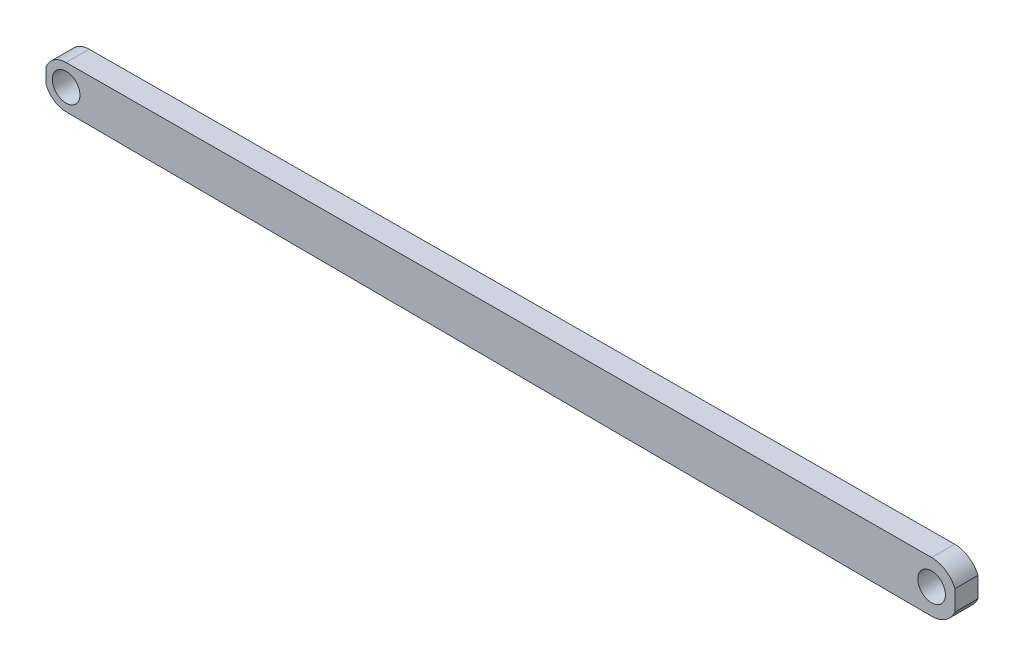
ISO-10303-21;
HEADER;
FILE_DESCRIPTION(('STEP AP214'),'2;1');
FILE_NAME('part.step','',(''),(''),'','','');
FILE_SCHEMA(('AUTOMOTIVE_DESIGN { 1 0 10303 214 1 1 1 1 }'));
ENDSEC;
DATA;
#1=APPLICATION_CONTEXT('core data for automotive mechanical design processes');
#2=APPLICATION_PROTOCOL_DEFINITION('international standard','automotive_design',2000,#1);
#3=PRODUCT_CONTEXT('',#1,'mechanical');
#4=PRODUCT('Part','Part','',(#3));
#5=PRODUCT_RELATED_PRODUCT_CATEGORY('part','',(#4));
#6=PRODUCT_DEFINITION_FORMATION('','',#4);
#7=PRODUCT_DEFINITION_CONTEXT('part definition',#1,'design');
#8=PRODUCT_DEFINITION('design','',#6,#7);
#9=PRODUCT_DEFINITION_SHAPE('','',#8);
#10=(LENGTH_UNIT() NAMED_UNIT(*) SI_UNIT(.MILLI.,.METRE.));
#11=(NAMED_UNIT(*) PLANE_ANGLE_UNIT() SI_UNIT($,.RADIAN.));
#12=(NAMED_UNIT(*) SI_UNIT($,.STERADIAN.) SOLID_ANGLE_UNIT());
#13=UNCERTAINTY_MEASURE_WITH_UNIT(LENGTH_MEASURE(1.E-05),#10,'distance_accuracy_value','');
#14=(GEOMETRIC_REPRESENTATION_CONTEXT(3) GLOBAL_UNCERTAINTY_ASSIGNED_CONTEXT((#13)) GLOBAL_UNIT_ASSIGNED_CONTEXT((#10,
#11,#12)) REPRESENTATION_CONTEXT('',''));
#15=CARTESIAN_POINT('',(0.,0.,0.));
#16=DIRECTION('',(0.,0.,1.));
#17=DIRECTION('',(1.,0.,0.));
#18=AXIS2_PLACEMENT_3D('',#15,#16,#17);
#19=CARTESIAN_POINT('',(0.,0.,5.));
#20=DIRECTION('',(0.,0.,1.));
#21=DIRECTION('',(1.,0.,0.));
#22=AXIS2_PLACEMENT_3D('',#19,#20,#21);
#23=PLANE('',#22);
#24=CARTESIAN_POINT('',(187.7624,0.,5.));
#25=DIRECTION('',(0.,0.,1.));
#26=DIRECTION('',(1.,0.,0.));
#27=AXIS2_PLACEMENT_3D('',#24,#25,#26);
#28=CIRCLE('',#27,3.00000007924962);
#29=CARTESIAN_POINT('',(190.76240007925,0.,5.));
#30=VERTEX_POINT('',#29);
#31=EDGE_CURVE('E169',#30,#30,#28,.T.);
#32=ORIENTED_EDGE('',*,*,#31,.F.);
#33=EDGE_LOOP('',(#32));
#34=FACE_BOUND('',#33,.T.);
#35=CARTESIAN_POINT('',(0.,0.,5.));
#36=DIRECTION('',(0.,0.,1.));
#37=DIRECTION('',(1.,0.,0.));
#38=AXIS2_PLACEMENT_3D('',#35,#36,#37);
#39=CIRCLE('',#38,3.00000007924961);
#40=CARTESIAN_POINT('',(3.00000007924961,0.,5.));
#41=VERTEX_POINT('',#40);
#42=EDGE_CURVE('E140',#41,#41,#39,.T.);
#43=ORIENTED_EDGE('',*,*,#42,.F.);
#44=EDGE_LOOP('',(#43));
#45=FACE_BOUND('',#44,.T.);
#46=CARTESIAN_POINT('',(0.,0.,5.));
#47=DIRECTION('',(0.,0.,1.));
#48=DIRECTION('',(1.,0.,0.));
#49=AXIS2_PLACEMENT_3D('',#46,#47,#48);
#50=CIRCLE('',#49,4.63518821296482);
#51=CARTESIAN_POINT('',(0.,4.63518821296482,5.));
#52=VERTEX_POINT('',#51);
#53=CARTESIAN_POINT('',(-4.35681947691644,1.58211687784739,5.));
#54=VERTEX_POINT('',#53);
#55=EDGE_CURVE('E154',#52,#54,#50,.T.);
#56=ORIENTED_EDGE('',*,*,#55,.T.);
#57=DIRECTION('',(0.,1.,0.));
#58=VECTOR('',#57,1.);
#59=CARTESIAN_POINT('',(-4.35681947691644,0.,5.));
#60=LINE('',#59,#58);
#61=CARTESIAN_POINT('',(-4.35681947691644,-1.58211687784739,5.));
#62=VERTEX_POINT('',#61);
#63=EDGE_CURVE('E101',#62,#54,#60,.T.);
#64=ORIENTED_EDGE('',*,*,#63,.F.);
#65=CARTESIAN_POINT('',(0.,-4.63518821296482,5.));
#66=VERTEX_POINT('',#65);
#67=EDGE_CURVE('E151',#62,#66,#50,.T.);
#68=ORIENTED_EDGE('',*,*,#67,.T.);
#69=DIRECTION('',(-0.999988830954034,0.00472630587074901,0.));
#70=VECTOR('',#69,1.);
#71=CARTESIAN_POINT('',(-0.0219070725791288,-4.63508467228263,5.));
#72=LINE('',#71,#70);
#73=CARTESIAN_POINT('',(187.7624,-5.52262065816452,5.));
#74=VERTEX_POINT('',#73);
#75=EDGE_CURVE('E160',#74,#66,#72,.T.);
#76=ORIENTED_EDGE('',*,*,#75,.F.);
#77=CARTESIAN_POINT('',(187.7624,0.,5.));
#78=DIRECTION('',(0.,0.,1.));
#79=DIRECTION('',(1.,0.,0.));
#80=AXIS2_PLACEMENT_3D('',#77,#78,#79);
#81=CIRCLE('',#80,5.52262065816452);
#82=CARTESIAN_POINT('',(192.829341952088,-2.19668800428204,5.));
#83=VERTEX_POINT('',#82);
#84=EDGE_CURVE('E166',#74,#83,#81,.T.);
#85=ORIENTED_EDGE('',*,*,#84,.T.);
#86=DIRECTION('',(0.,-1.,0.));
#87=VECTOR('',#86,1.);
#88=CARTESIAN_POINT('',(192.829341952088,0.,5.));
#89=LINE('',#88,#87);
#90=CARTESIAN_POINT('',(192.829341952088,2.19668800428204,5.));
#91=VERTEX_POINT('',#90);
#92=EDGE_CURVE('E155',#91,#83,#89,.T.);
#93=ORIENTED_EDGE('',*,*,#92,.F.);
#94=CARTESIAN_POINT('',(187.7624,5.52262065816452,5.));
#95=VERTEX_POINT('',#94);
#96=EDGE_CURVE('E165',#91,#95,#81,.T.);
#97=ORIENTED_EDGE('',*,*,#96,.T.);
#98=DIRECTION('',(-0.999988830954034,-0.00472630587074901,0.));
#99=VECTOR('',#98,1.);
#100=CARTESIAN_POINT('',(-0.0219070725791288,4.63508467228263,5.));
#101=LINE('',#100,#99);
#102=EDGE_CURVE('E135',#95,#52,#101,.T.);
#103=ORIENTED_EDGE('',*,*,#102,.T.);
#104=EDGE_LOOP('',(#56,#64,#68,#76,#85,#93,#97,#103));
#105=FACE_BOUND('',#104,.T.);
#106=ADVANCED_FACE('F37',(#34,#45,#105),#23,.T.);
#107=CARTESIAN_POINT('',(0.,0.,0.));
#108=DIRECTION('',(0.,0.,1.));
#109=DIRECTION('',(1.,0.,0.));
#110=AXIS2_PLACEMENT_3D('',#107,#108,#109);
#111=PLANE('',#110);
#112=CARTESIAN_POINT('',(187.7624,0.,0.));
#113=DIRECTION('',(0.,0.,1.));
#114=DIRECTION('',(1.,0.,0.));
#115=AXIS2_PLACEMENT_3D('',#112,#113,#114);
#116=CIRCLE('',#115,3.00000007924962);
#117=CARTESIAN_POINT('',(190.76240007925,0.,0.));
#118=VERTEX_POINT('',#117);
#119=EDGE_CURVE('E129',#118,#118,#116,.T.);
#120=ORIENTED_EDGE('',*,*,#119,.T.);
#121=EDGE_LOOP('',(#120));
#122=FACE_BOUND('',#121,.T.);
#123=CARTESIAN_POINT('',(0.,0.,0.));
#124=DIRECTION('',(0.,0.,1.));
#125=DIRECTION('',(1.,0.,0.));
#126=AXIS2_PLACEMENT_3D('',#123,#124,#125);
#127=CIRCLE('',#126,3.00000007924961);
#128=CARTESIAN_POINT('',(3.00000007924961,0.,0.));
#129=VERTEX_POINT('',#128);
#130=EDGE_CURVE('E132',#129,#129,#127,.T.);
#131=ORIENTED_EDGE('',*,*,#130,.T.);
#132=EDGE_LOOP('',(#131));
#133=FACE_BOUND('',#132,.T.);
#134=DIRECTION('',(0.,1.,0.));
#135=VECTOR('',#134,1.);
#136=CARTESIAN_POINT('',(-4.35681947691644,0.,0.));
#137=LINE('',#136,#135);
#138=CARTESIAN_POINT('',(-4.35681947691644,-1.58211687784739,0.));
#139=VERTEX_POINT('',#138);
#140=CARTESIAN_POINT('',(-4.35681947691644,1.58211687784739,0.));
#141=VERTEX_POINT('',#140);
#142=EDGE_CURVE('E51',#139,#141,#137,.T.);
#143=ORIENTED_EDGE('',*,*,#142,.T.);
#144=CARTESIAN_POINT('',(0.,0.,0.));
#145=DIRECTION('',(0.,0.,1.));
#146=DIRECTION('',(1.,0.,0.));
#147=AXIS2_PLACEMENT_3D('',#144,#145,#146);
#148=CIRCLE('',#147,4.63518821296482);
#149=CARTESIAN_POINT('',(0.,4.63518821296482,0.));
#150=VERTEX_POINT('',#149);
#151=EDGE_CURVE('E109',#150,#141,#148,.T.);
#152=ORIENTED_EDGE('',*,*,#151,.F.);
#153=DIRECTION('',(-0.999988830954034,-0.00472630587074901,0.));
#154=VECTOR('',#153,1.);
#155=CARTESIAN_POINT('',(-0.0219070725791288,4.63508467228263,0.));
#156=LINE('',#155,#154);
#157=CARTESIAN_POINT('',(187.7624,5.52262065816452,0.));
#158=VERTEX_POINT('',#157);
#159=EDGE_CURVE('E122',#158,#150,#156,.T.);
#160=ORIENTED_EDGE('',*,*,#159,.F.);
#161=CARTESIAN_POINT('',(187.7624,0.,0.));
#162=DIRECTION('',(0.,0.,1.));
#163=DIRECTION('',(1.,0.,0.));
#164=AXIS2_PLACEMENT_3D('',#161,#162,#163);
#165=CIRCLE('',#164,5.52262065816452);
#166=CARTESIAN_POINT('',(192.829341952088,2.19668800428204,0.));
#167=VERTEX_POINT('',#166);
#168=EDGE_CURVE('E120',#167,#158,#165,.T.);
#169=ORIENTED_EDGE('',*,*,#168,.F.);
#170=DIRECTION('',(0.,1.,0.));
#171=VECTOR('',#170,1.);
#172=CARTESIAN_POINT('',(192.829341952088,0.,0.));
#173=LINE('',#172,#171);
#174=CARTESIAN_POINT('',(192.829341952088,-2.19668800428204,0.));
#175=VERTEX_POINT('',#174);
#176=EDGE_CURVE('E146',#175,#167,#173,.T.);
#177=ORIENTED_EDGE('',*,*,#176,.F.);
#178=CARTESIAN_POINT('',(187.7624,-5.52262065816452,0.));
#179=VERTEX_POINT('',#178);
#180=EDGE_CURVE('E126',#179,#175,#165,.T.);
#181=ORIENTED_EDGE('',*,*,#180,.F.);
#182=DIRECTION('',(-0.999988830954034,0.00472630587074901,0.));
#183=VECTOR('',#182,1.);
#184=CARTESIAN_POINT('',(-0.0219070725791288,-4.63508467228263,0.));
#185=LINE('',#184,#183);
#186=CARTESIAN_POINT('',(0.,-4.63518821296482,0.));
#187=VERTEX_POINT('',#186);
#188=EDGE_CURVE('E118',#179,#187,#185,.T.);
#189=ORIENTED_EDGE('',*,*,#188,.T.);
#190=EDGE_CURVE('E112',#139,#187,#148,.T.);
#191=ORIENTED_EDGE('',*,*,#190,.F.);
#192=EDGE_LOOP('',(#143,#152,#160,#169,#177,#181,#189,#191));
#193=FACE_BOUND('',#192,.T.);
#194=ADVANCED_FACE('F107',(#122,#133,#193),#111,.F.);
#195=CARTESIAN_POINT('',(0.,0.,5.));
#196=DIRECTION('',(0.,0.,-1.));
#197=DIRECTION('',(-1.,0.,0.));
#198=AXIS2_PLACEMENT_3D('',#195,#196,#197);
#199=CYLINDRICAL_SURFACE('',#198,4.63518821296482);
#200=DIRECTION('',(0.,0.,-1.));
#201=VECTOR('',#200,1.);
#202=CARTESIAN_POINT('',(-4.35681947691644,1.58211687784739,5.));
#203=LINE('',#202,#201);
#204=EDGE_CURVE('E11',#54,#141,#203,.T.);
#205=ORIENTED_EDGE('',*,*,#204,.F.);
#206=ORIENTED_EDGE('',*,*,#55,.F.);
#207=DIRECTION('',(0.,0.,-1.));
#208=VECTOR('',#207,1.);
#209=CARTESIAN_POINT('',(0.,4.63518821296482,5.));
#210=LINE('',#209,#208);
#211=EDGE_CURVE('E116',#52,#150,#210,.T.);
#212=ORIENTED_EDGE('',*,*,#211,.T.);
#213=ORIENTED_EDGE('',*,*,#151,.T.);
#214=EDGE_LOOP('',(#205,#206,#212,#213));
#215=FACE_BOUND('',#214,.T.);
#216=ADVANCED_FACE('F114',(#215),#199,.T.);
#217=DIRECTION('',(0.,0.,-1.));
#218=VECTOR('',#217,1.);
#219=CARTESIAN_POINT('',(-4.35681947691644,-1.58211687784739,5.));
#220=LINE('',#219,#218);
#221=EDGE_CURVE('E45',#139,#62,#220,.F.);
#222=ORIENTED_EDGE('',*,*,#221,.F.);
#223=ORIENTED_EDGE('',*,*,#190,.T.);
#224=DIRECTION('',(0.,0.,-1.));
#225=VECTOR('',#224,1.);
#226=CARTESIAN_POINT('',(0.,-4.63518821296482,5.));
#227=LINE('',#226,#225);
#228=EDGE_CURVE('E142',#66,#187,#227,.T.);
#229=ORIENTED_EDGE('',*,*,#228,.F.);
#230=ORIENTED_EDGE('',*,*,#67,.F.);
#231=EDGE_LOOP('',(#222,#223,#229,#230));
#232=FACE_BOUND('',#231,.T.);
#233=ADVANCED_FACE('F157',(#232),#199,.T.);
#234=CARTESIAN_POINT('',(187.7624,0.,5.));
#235=DIRECTION('',(0.,0.,-1.));
#236=DIRECTION('',(-1.,0.,0.));
#237=AXIS2_PLACEMENT_3D('',#234,#235,#236);
#238=CYLINDRICAL_SURFACE('',#237,5.52262065816452);
#239=DIRECTION('',(0.,0.,-1.));
#240=VECTOR('',#239,1.);
#241=CARTESIAN_POINT('',(192.829341952088,-2.19668800428204,5.));
#242=LINE('',#241,#240);
#243=EDGE_CURVE('E59',#83,#175,#242,.T.);
#244=ORIENTED_EDGE('',*,*,#243,.F.);
#245=ORIENTED_EDGE('',*,*,#84,.F.);
#246=DIRECTION('',(0.,0.,-1.));
#247=VECTOR('',#246,1.);
#248=CARTESIAN_POINT('',(187.7624,-5.52262065816452,5.));
#249=LINE('',#248,#247);
#250=EDGE_CURVE('E139',#74,#179,#249,.T.);
#251=ORIENTED_EDGE('',*,*,#250,.T.);
#252=ORIENTED_EDGE('',*,*,#180,.T.);
#253=EDGE_LOOP('',(#244,#245,#251,#252));
#254=FACE_BOUND('',#253,.T.);
#255=ADVANCED_FACE('F197',(#254),#238,.T.);
#256=DIRECTION('',(0.,0.,-1.));
#257=VECTOR('',#256,1.);
#258=CARTESIAN_POINT('',(192.829341952088,2.19668800428204,5.));
#259=LINE('',#258,#257);
#260=EDGE_CURVE('E333',#167,#91,#259,.F.);
#261=ORIENTED_EDGE('',*,*,#260,.F.);
#262=ORIENTED_EDGE('',*,*,#168,.T.);
#263=DIRECTION('',(0.,0.,-1.));
#264=VECTOR('',#263,1.);
#265=CARTESIAN_POINT('',(187.7624,5.52262065816452,5.));
#266=LINE('',#265,#264);
#267=EDGE_CURVE('E136',#95,#158,#266,.T.);
#268=ORIENTED_EDGE('',*,*,#267,.F.);
#269=ORIENTED_EDGE('',*,*,#96,.F.);
#270=EDGE_LOOP('',(#261,#262,#268,#269));
#271=FACE_BOUND('',#270,.T.);
#272=ADVANCED_FACE('F200',(#271),#238,.T.);
#273=CARTESIAN_POINT('',(-0.0219070725791288,4.63508467228263,5.));
#274=DIRECTION('',(0.00472630587074901,-0.999988830954034,0.));
#275=DIRECTION('',(0.999988830954034,0.00472630587074901,0.));
#276=AXIS2_PLACEMENT_3D('',#273,#274,#275);
#277=PLANE('',#276);
#278=ORIENTED_EDGE('',*,*,#159,.T.);
#279=ORIENTED_EDGE('',*,*,#211,.F.);
#280=ORIENTED_EDGE('',*,*,#102,.F.);
#281=ORIENTED_EDGE('',*,*,#267,.T.);
#282=EDGE_LOOP('',(#278,#279,#280,#281));
#283=FACE_BOUND('',#282,.T.);
#284=ADVANCED_FACE('F39',(#283),#277,.F.);
#285=CARTESIAN_POINT('',(-0.0219070725791288,-4.63508467228263,5.));
#286=DIRECTION('',(-0.00472630587074901,-0.999988830954034,0.));
#287=DIRECTION('',(0.999988830954034,-0.00472630587074901,0.));
#288=AXIS2_PLACEMENT_3D('',#285,#286,#287);
#289=PLANE('',#288);
#290=ORIENTED_EDGE('',*,*,#188,.F.);
#291=ORIENTED_EDGE('',*,*,#250,.F.);
#292=ORIENTED_EDGE('',*,*,#75,.T.);
#293=ORIENTED_EDGE('',*,*,#228,.T.);
#294=EDGE_LOOP('',(#290,#291,#292,#293));
#295=FACE_BOUND('',#294,.T.);
#296=ADVANCED_FACE('F195',(#295),#289,.T.);
#297=CARTESIAN_POINT('',(187.7624,0.,5.));
#298=DIRECTION('',(0.,0.,-1.));
#299=DIRECTION('',(-1.,0.,0.));
#300=AXIS2_PLACEMENT_3D('',#297,#298,#299);
#301=CYLINDRICAL_SURFACE('',#300,3.00000007924962);
#302=ORIENTED_EDGE('',*,*,#31,.T.);
#303=EDGE_LOOP('',(#302));
#304=FACE_BOUND('',#303,.T.);
#305=ORIENTED_EDGE('',*,*,#119,.F.);
#306=EDGE_LOOP('',(#305));
#307=FACE_BOUND('',#306,.T.);
#308=ADVANCED_FACE('F192',(#304,#307),#301,.F.);
#309=CARTESIAN_POINT('',(0.,0.,5.));
#310=DIRECTION('',(0.,0.,-1.));
#311=DIRECTION('',(-1.,0.,0.));
#312=AXIS2_PLACEMENT_3D('',#309,#310,#311);
#313=CYLINDRICAL_SURFACE('',#312,3.00000007924961);
#314=ORIENTED_EDGE('',*,*,#42,.T.);
#315=EDGE_LOOP('',(#314));
#316=FACE_BOUND('',#315,.T.);
#317=ORIENTED_EDGE('',*,*,#130,.F.);
#318=EDGE_LOOP('',(#317));
#319=FACE_BOUND('',#318,.T.);
#320=ADVANCED_FACE('F174',(#316,#319),#313,.F.);
#321=CARTESIAN_POINT('',(192.829341952088,0.,5.));
#322=DIRECTION('',(1.,0.,0.));
#323=DIRECTION('',(0.,0.,-1.));
#324=AXIS2_PLACEMENT_3D('',#321,#322,#323);
#325=PLANE('',#324);
#326=ORIENTED_EDGE('',*,*,#243,.T.);
#327=ORIENTED_EDGE('',*,*,#176,.T.);
#328=ORIENTED_EDGE('',*,*,#260,.T.);
#329=ORIENTED_EDGE('',*,*,#92,.T.);
#330=EDGE_LOOP('',(#326,#327,#328,#329));
#331=FACE_BOUND('',#330,.T.);
#332=ADVANCED_FACE('F187',(#331),#325,.T.);
#333=CARTESIAN_POINT('',(-4.35681947691644,0.,5.));
#334=DIRECTION('',(-1.,0.,0.));
#335=DIRECTION('',(0.,0.,1.));
#336=AXIS2_PLACEMENT_3D('',#333,#334,#335);
#337=PLANE('',#336);
#338=ORIENTED_EDGE('',*,*,#204,.T.);
#339=ORIENTED_EDGE('',*,*,#142,.F.);
#340=ORIENTED_EDGE('',*,*,#221,.T.);
#341=ORIENTED_EDGE('',*,*,#63,.T.);
#342=EDGE_LOOP('',(#338,#339,#340,#341));
#343=FACE_BOUND('',#342,.T.);
#344=ADVANCED_FACE('F99',(#343),#337,.T.);
#345=CLOSED_SHELL('',(#106,#194,#216,#233,#255,#272,#284,#296,#308,#320,#332,#344));
#346=MANIFOLD_SOLID_BREP('B2',#345);
#347=ADVANCED_BREP_SHAPE_REPRESENTATION('',(#18,#346),#14);
#348=SHAPE_DEFINITION_REPRESENTATION(#9,#347);
ENDSEC;
END-ISO-10303-21;
